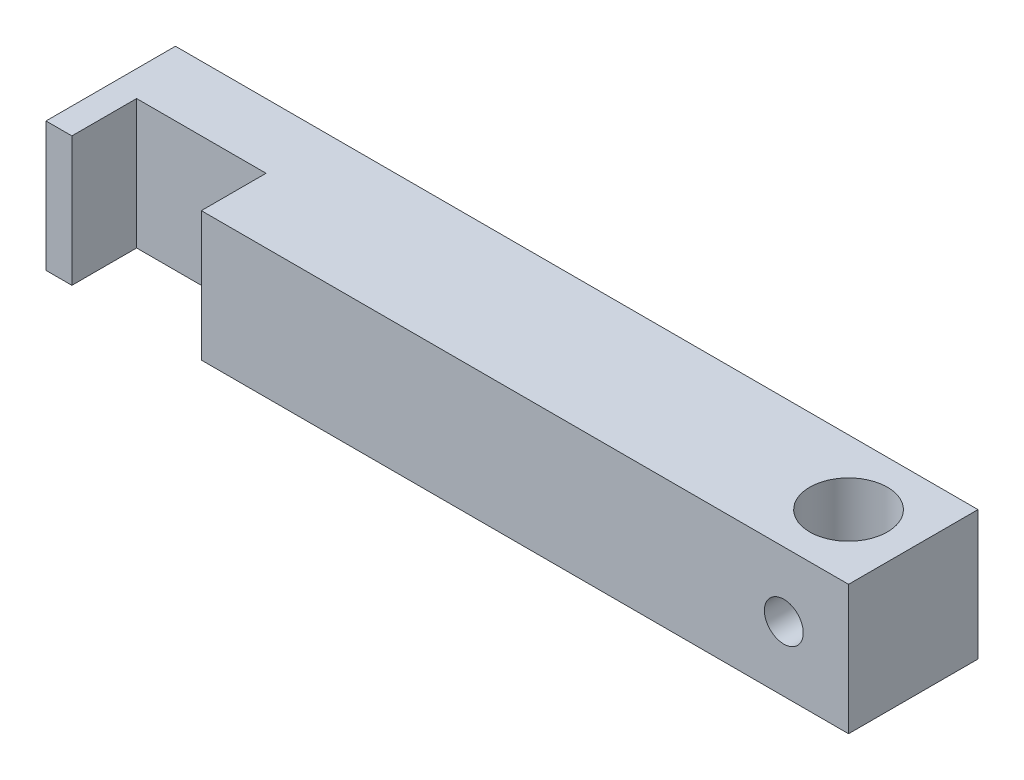
ISO-10303-21;
HEADER;
FILE_DESCRIPTION(('STEP AP214'),'2;1');
FILE_NAME('part.step','',(''),(''),'','','');
FILE_SCHEMA(('AUTOMOTIVE_DESIGN { 1 0 10303 214 1 1 1 1 }'));
ENDSEC;
DATA;
#1=APPLICATION_CONTEXT('core data for automotive mechanical design processes');
#2=APPLICATION_PROTOCOL_DEFINITION('international standard','automotive_design',2000,#1);
#3=PRODUCT_CONTEXT('',#1,'mechanical');
#4=PRODUCT('Part','Part','',(#3));
#5=PRODUCT_RELATED_PRODUCT_CATEGORY('part','',(#4));
#6=PRODUCT_DEFINITION_FORMATION('','',#4);
#7=PRODUCT_DEFINITION_CONTEXT('part definition',#1,'design');
#8=PRODUCT_DEFINITION('design','',#6,#7);
#9=PRODUCT_DEFINITION_SHAPE('','',#8);
#10=(LENGTH_UNIT() NAMED_UNIT(*) SI_UNIT(.MILLI.,.METRE.));
#11=(NAMED_UNIT(*) PLANE_ANGLE_UNIT() SI_UNIT($,.RADIAN.));
#12=(NAMED_UNIT(*) SI_UNIT($,.STERADIAN.) SOLID_ANGLE_UNIT());
#13=UNCERTAINTY_MEASURE_WITH_UNIT(LENGTH_MEASURE(1.E-05),#10,'distance_accuracy_value','');
#14=(GEOMETRIC_REPRESENTATION_CONTEXT(3) GLOBAL_UNCERTAINTY_ASSIGNED_CONTEXT((#13)) GLOBAL_UNIT_ASSIGNED_CONTEXT((#10,
#11,#12)) REPRESENTATION_CONTEXT('',''));
#15=CARTESIAN_POINT('',(0.,0.,0.));
#16=DIRECTION('',(0.,0.,1.));
#17=DIRECTION('',(1.,0.,0.));
#18=AXIS2_PLACEMENT_3D('',#15,#16,#17);
#19=CARTESIAN_POINT('',(0.,5.,0.));
#20=DIRECTION('',(0.,1.,0.));
#21=DIRECTION('',(0.,0.,1.));
#22=AXIS2_PLACEMENT_3D('',#19,#20,#21);
#23=PLANE('',#22);
#24=DIRECTION('',(0.,0.,1.));
#25=VECTOR('',#24,1.);
#26=CARTESIAN_POINT('',(-57.,5.,-5.));
#27=LINE('',#26,#25);
#28=CARTESIAN_POINT('',(-57.,5.,-5.));
#29=VERTEX_POINT('',#28);
#30=CARTESIAN_POINT('',(-57.,5.,5.));
#31=VERTEX_POINT('',#30);
#32=EDGE_CURVE('E155',#29,#31,#27,.T.);
#33=ORIENTED_EDGE('',*,*,#32,.T.);
#34=DIRECTION('',(1.,0.,0.));
#35=VECTOR('',#34,1.);
#36=CARTESIAN_POINT('',(-57.,5.,5.));
#37=LINE('',#36,#35);
#38=CARTESIAN_POINT('',(-55.,5.,5.));
#39=VERTEX_POINT('',#38);
#40=EDGE_CURVE('E103',#31,#39,#37,.T.);
#41=ORIENTED_EDGE('',*,*,#40,.T.);
#42=DIRECTION('',(0.,0.,-1.));
#43=VECTOR('',#42,1.);
#44=CARTESIAN_POINT('',(-55.,5.,5.));
#45=LINE('',#44,#43);
#46=CARTESIAN_POINT('',(-55.,5.,0.));
#47=VERTEX_POINT('',#46);
#48=EDGE_CURVE('E227',#39,#47,#45,.T.);
#49=ORIENTED_EDGE('',*,*,#48,.T.);
#50=DIRECTION('',(1.,0.,0.));
#51=VECTOR('',#50,1.);
#52=CARTESIAN_POINT('',(-55.,5.,0.));
#53=LINE('',#52,#51);
#54=CARTESIAN_POINT('',(-45.,5.,0.));
#55=VERTEX_POINT('',#54);
#56=EDGE_CURVE('E233',#47,#55,#53,.T.);
#57=ORIENTED_EDGE('',*,*,#56,.T.);
#58=DIRECTION('',(0.,0.,1.));
#59=VECTOR('',#58,1.);
#60=CARTESIAN_POINT('',(-45.,5.,0.));
#61=LINE('',#60,#59);
#62=CARTESIAN_POINT('',(-45.,5.,5.));
#63=VERTEX_POINT('',#62);
#64=EDGE_CURVE('E122',#55,#63,#61,.T.);
#65=ORIENTED_EDGE('',*,*,#64,.T.);
#66=DIRECTION('',(1.,0.,0.));
#67=VECTOR('',#66,1.);
#68=CARTESIAN_POINT('',(-45.,5.,5.));
#69=LINE('',#68,#67);
#70=CARTESIAN_POINT('',(5.,5.,5.));
#71=VERTEX_POINT('',#70);
#72=EDGE_CURVE('E116',#63,#71,#69,.T.);
#73=ORIENTED_EDGE('',*,*,#72,.T.);
#74=DIRECTION('',(0.,0.,-1.));
#75=VECTOR('',#74,1.);
#76=CARTESIAN_POINT('',(5.,5.,-5.));
#77=LINE('',#76,#75);
#78=CARTESIAN_POINT('',(5.,5.,-5.));
#79=VERTEX_POINT('',#78);
#80=EDGE_CURVE('E120',#71,#79,#77,.T.);
#81=ORIENTED_EDGE('',*,*,#80,.T.);
#82=DIRECTION('',(-1.,0.,0.));
#83=VECTOR('',#82,1.);
#84=CARTESIAN_POINT('',(-57.,5.,-5.));
#85=LINE('',#84,#83);
#86=EDGE_CURVE('E60',#79,#29,#85,.T.);
#87=ORIENTED_EDGE('',*,*,#86,.T.);
#88=EDGE_LOOP('',(#33,#41,#49,#57,#65,#73,#81,#87));
#89=FACE_BOUND('',#88,.T.);
#90=CARTESIAN_POINT('',(0.,5.,0.));
#91=DIRECTION('',(0.,1.,0.));
#92=DIRECTION('',(0.,0.,1.));
#93=AXIS2_PLACEMENT_3D('',#90,#91,#92);
#94=CIRCLE('',#93,3.);
#95=CARTESIAN_POINT('',(0.,5.,3.));
#96=VERTEX_POINT('',#95);
#97=EDGE_CURVE('E144',#96,#96,#94,.T.);
#98=ORIENTED_EDGE('',*,*,#97,.F.);
#99=EDGE_LOOP('',(#98));
#100=FACE_BOUND('',#99,.T.);
#101=ADVANCED_FACE('F36',(#89,#100),#23,.T.);
#102=CARTESIAN_POINT('',(0.,-5.,0.));
#103=DIRECTION('',(0.,1.,0.));
#104=DIRECTION('',(0.,0.,1.));
#105=AXIS2_PLACEMENT_3D('',#102,#103,#104);
#106=PLANE('',#105);
#107=DIRECTION('',(0.,0.,1.));
#108=VECTOR('',#107,1.);
#109=CARTESIAN_POINT('',(-57.,-5.,-5.));
#110=LINE('',#109,#108);
#111=CARTESIAN_POINT('',(-57.,-5.,-5.));
#112=VERTEX_POINT('',#111);
#113=CARTESIAN_POINT('',(-57.,-5.,5.));
#114=VERTEX_POINT('',#113);
#115=EDGE_CURVE('E140',#112,#114,#110,.T.);
#116=ORIENTED_EDGE('',*,*,#115,.F.);
#117=DIRECTION('',(-1.,0.,0.));
#118=VECTOR('',#117,1.);
#119=CARTESIAN_POINT('',(-57.,-5.,-5.));
#120=LINE('',#119,#118);
#121=CARTESIAN_POINT('',(5.,-5.,-5.));
#122=VERTEX_POINT('',#121);
#123=EDGE_CURVE('E95',#122,#112,#120,.T.);
#124=ORIENTED_EDGE('',*,*,#123,.F.);
#125=DIRECTION('',(0.,0.,-1.));
#126=VECTOR('',#125,1.);
#127=CARTESIAN_POINT('',(5.,-5.,-5.));
#128=LINE('',#127,#126);
#129=CARTESIAN_POINT('',(5.,-5.,5.));
#130=VERTEX_POINT('',#129);
#131=EDGE_CURVE('E89',#130,#122,#128,.T.);
#132=ORIENTED_EDGE('',*,*,#131,.F.);
#133=DIRECTION('',(1.,0.,0.));
#134=VECTOR('',#133,1.);
#135=CARTESIAN_POINT('',(-45.,-5.,5.));
#136=LINE('',#135,#134);
#137=CARTESIAN_POINT('',(-45.,-5.,5.));
#138=VERTEX_POINT('',#137);
#139=EDGE_CURVE('E130',#138,#130,#136,.T.);
#140=ORIENTED_EDGE('',*,*,#139,.F.);
#141=DIRECTION('',(0.,0.,1.));
#142=VECTOR('',#141,1.);
#143=CARTESIAN_POINT('',(-45.,-5.,0.));
#144=LINE('',#143,#142);
#145=CARTESIAN_POINT('',(-45.,-5.,0.));
#146=VERTEX_POINT('',#145);
#147=EDGE_CURVE('E150',#146,#138,#144,.T.);
#148=ORIENTED_EDGE('',*,*,#147,.F.);
#149=DIRECTION('',(1.,0.,0.));
#150=VECTOR('',#149,1.);
#151=CARTESIAN_POINT('',(-55.,-5.,0.));
#152=LINE('',#151,#150);
#153=CARTESIAN_POINT('',(-55.,-5.,0.));
#154=VERTEX_POINT('',#153);
#155=EDGE_CURVE('E148',#154,#146,#152,.T.);
#156=ORIENTED_EDGE('',*,*,#155,.F.);
#157=DIRECTION('',(0.,0.,-1.));
#158=VECTOR('',#157,1.);
#159=CARTESIAN_POINT('',(-55.,-5.,5.));
#160=LINE('',#159,#158);
#161=CARTESIAN_POINT('',(-55.,-5.,5.));
#162=VERTEX_POINT('',#161);
#163=EDGE_CURVE('E146',#162,#154,#160,.T.);
#164=ORIENTED_EDGE('',*,*,#163,.F.);
#165=DIRECTION('',(1.,0.,0.));
#166=VECTOR('',#165,1.);
#167=CARTESIAN_POINT('',(-57.,-5.,5.));
#168=LINE('',#167,#166);
#169=EDGE_CURVE('E143',#114,#162,#168,.T.);
#170=ORIENTED_EDGE('',*,*,#169,.F.);
#171=EDGE_LOOP('',(#116,#124,#132,#140,#148,#156,#164,#170));
#172=FACE_BOUND('',#171,.T.);
#173=CARTESIAN_POINT('',(0.,-5.,0.));
#174=DIRECTION('',(0.,1.,0.));
#175=DIRECTION('',(0.,0.,1.));
#176=AXIS2_PLACEMENT_3D('',#173,#174,#175);
#177=CIRCLE('',#176,3.);
#178=CARTESIAN_POINT('',(0.,-5.,3.));
#179=VERTEX_POINT('',#178);
#180=EDGE_CURVE('E239',#179,#179,#177,.T.);
#181=ORIENTED_EDGE('',*,*,#180,.T.);
#182=EDGE_LOOP('',(#181));
#183=FACE_BOUND('',#182,.T.);
#184=ADVANCED_FACE('F190',(#172,#183),#106,.F.);
#185=CARTESIAN_POINT('',(-57.,5.,-5.));
#186=DIRECTION('',(1.,0.,0.));
#187=DIRECTION('',(0.,0.,-1.));
#188=AXIS2_PLACEMENT_3D('',#185,#186,#187);
#189=PLANE('',#188);
#190=ORIENTED_EDGE('',*,*,#115,.T.);
#191=DIRECTION('',(0.,-1.,0.));
#192=VECTOR('',#191,1.);
#193=CARTESIAN_POINT('',(-57.,5.,5.));
#194=LINE('',#193,#192);
#195=EDGE_CURVE('E11',#31,#114,#194,.T.);
#196=ORIENTED_EDGE('',*,*,#195,.F.);
#197=ORIENTED_EDGE('',*,*,#32,.F.);
#198=DIRECTION('',(0.,-1.,0.));
#199=VECTOR('',#198,1.);
#200=CARTESIAN_POINT('',(-57.,5.,-5.));
#201=LINE('',#200,#199);
#202=EDGE_CURVE('E136',#29,#112,#201,.T.);
#203=ORIENTED_EDGE('',*,*,#202,.T.);
#204=EDGE_LOOP('',(#190,#196,#197,#203));
#205=FACE_BOUND('',#204,.T.);
#206=ADVANCED_FACE('F38',(#205),#189,.F.);
#207=CARTESIAN_POINT('',(-57.,5.,5.));
#208=DIRECTION('',(0.,0.,-1.));
#209=DIRECTION('',(-1.,0.,0.));
#210=AXIS2_PLACEMENT_3D('',#207,#208,#209);
#211=PLANE('',#210);
#212=ORIENTED_EDGE('',*,*,#169,.T.);
#213=DIRECTION('',(0.,-1.,0.));
#214=VECTOR('',#213,1.);
#215=CARTESIAN_POINT('',(-55.,5.,5.));
#216=LINE('',#215,#214);
#217=EDGE_CURVE('E51',#39,#162,#216,.T.);
#218=ORIENTED_EDGE('',*,*,#217,.F.);
#219=ORIENTED_EDGE('',*,*,#40,.F.);
#220=ORIENTED_EDGE('',*,*,#195,.T.);
#221=EDGE_LOOP('',(#212,#218,#219,#220));
#222=FACE_BOUND('',#221,.T.);
#223=ADVANCED_FACE('F215',(#222),#211,.F.);
#224=CARTESIAN_POINT('',(-55.,5.,5.));
#225=DIRECTION('',(-1.,0.,0.));
#226=DIRECTION('',(0.,0.,1.));
#227=AXIS2_PLACEMENT_3D('',#224,#225,#226);
#228=PLANE('',#227);
#229=ORIENTED_EDGE('',*,*,#163,.T.);
#230=DIRECTION('',(0.,-1.,0.));
#231=VECTOR('',#230,1.);
#232=CARTESIAN_POINT('',(-55.,5.,0.));
#233=LINE('',#232,#231);
#234=EDGE_CURVE('E162',#47,#154,#233,.T.);
#235=ORIENTED_EDGE('',*,*,#234,.F.);
#236=ORIENTED_EDGE('',*,*,#48,.F.);
#237=ORIENTED_EDGE('',*,*,#217,.T.);
#238=EDGE_LOOP('',(#229,#235,#236,#237));
#239=FACE_BOUND('',#238,.T.);
#240=ADVANCED_FACE('F212',(#239),#228,.F.);
#241=CARTESIAN_POINT('',(-55.,5.,0.));
#242=DIRECTION('',(0.,0.,-1.));
#243=DIRECTION('',(-1.,0.,0.));
#244=AXIS2_PLACEMENT_3D('',#241,#242,#243);
#245=PLANE('',#244);
#246=ORIENTED_EDGE('',*,*,#155,.T.);
#247=DIRECTION('',(0.,-1.,0.));
#248=VECTOR('',#247,1.);
#249=CARTESIAN_POINT('',(-45.,5.,0.));
#250=LINE('',#249,#248);
#251=EDGE_CURVE('E159',#55,#146,#250,.T.);
#252=ORIENTED_EDGE('',*,*,#251,.F.);
#253=ORIENTED_EDGE('',*,*,#56,.F.);
#254=ORIENTED_EDGE('',*,*,#234,.T.);
#255=EDGE_LOOP('',(#246,#252,#253,#254));
#256=FACE_BOUND('',#255,.T.);
#257=ADVANCED_FACE('F208',(#256),#245,.F.);
#258=CARTESIAN_POINT('',(-45.,5.,0.));
#259=DIRECTION('',(1.,0.,0.));
#260=DIRECTION('',(0.,0.,-1.));
#261=AXIS2_PLACEMENT_3D('',#258,#259,#260);
#262=PLANE('',#261);
#263=ORIENTED_EDGE('',*,*,#147,.T.);
#264=DIRECTION('',(0.,-1.,0.));
#265=VECTOR('',#264,1.);
#266=CARTESIAN_POINT('',(-45.,5.,5.));
#267=LINE('',#266,#265);
#268=EDGE_CURVE('E131',#63,#138,#267,.T.);
#269=ORIENTED_EDGE('',*,*,#268,.F.);
#270=ORIENTED_EDGE('',*,*,#64,.F.);
#271=ORIENTED_EDGE('',*,*,#251,.T.);
#272=EDGE_LOOP('',(#263,#269,#270,#271));
#273=FACE_BOUND('',#272,.T.);
#274=ADVANCED_FACE('F204',(#273),#262,.F.);
#275=CARTESIAN_POINT('',(-45.,5.,5.));
#276=DIRECTION('',(0.,0.,-1.));
#277=DIRECTION('',(-1.,0.,0.));
#278=AXIS2_PLACEMENT_3D('',#275,#276,#277);
#279=PLANE('',#278);
#280=CARTESIAN_POINT('',(0.,0.,5.));
#281=DIRECTION('',(0.,0.,1.));
#282=DIRECTION('',(1.,0.,0.));
#283=AXIS2_PLACEMENT_3D('',#280,#281,#282);
#284=CIRCLE('',#283,1.5);
#285=CARTESIAN_POINT('',(1.5,0.,5.));
#286=VERTEX_POINT('',#285);
#287=EDGE_CURVE('E244',#286,#286,#284,.T.);
#288=ORIENTED_EDGE('',*,*,#287,.F.);
#289=EDGE_LOOP('',(#288));
#290=FACE_BOUND('',#289,.T.);
#291=ORIENTED_EDGE('',*,*,#139,.T.);
#292=DIRECTION('',(0.,-1.,0.));
#293=VECTOR('',#292,1.);
#294=CARTESIAN_POINT('',(5.,5.,5.));
#295=LINE('',#294,#293);
#296=EDGE_CURVE('E127',#71,#130,#295,.T.);
#297=ORIENTED_EDGE('',*,*,#296,.F.);
#298=ORIENTED_EDGE('',*,*,#72,.F.);
#299=ORIENTED_EDGE('',*,*,#268,.T.);
#300=EDGE_LOOP('',(#291,#297,#298,#299));
#301=FACE_BOUND('',#300,.T.);
#302=ADVANCED_FACE('F128',(#290,#301),#279,.F.);
#303=CARTESIAN_POINT('',(5.,5.,-5.));
#304=DIRECTION('',(-1.,0.,0.));
#305=DIRECTION('',(0.,0.,1.));
#306=AXIS2_PLACEMENT_3D('',#303,#304,#305);
#307=PLANE('',#306);
#308=ORIENTED_EDGE('',*,*,#131,.T.);
#309=DIRECTION('',(0.,-1.,0.));
#310=VECTOR('',#309,1.);
#311=CARTESIAN_POINT('',(5.,5.,-5.));
#312=LINE('',#311,#310);
#313=EDGE_CURVE('E132',#79,#122,#312,.T.);
#314=ORIENTED_EDGE('',*,*,#313,.F.);
#315=ORIENTED_EDGE('',*,*,#80,.F.);
#316=ORIENTED_EDGE('',*,*,#296,.T.);
#317=EDGE_LOOP('',(#308,#314,#315,#316));
#318=FACE_BOUND('',#317,.T.);
#319=ADVANCED_FACE('F134',(#318),#307,.F.);
#320=CARTESIAN_POINT('',(-57.,5.,-5.));
#321=DIRECTION('',(0.,0.,1.));
#322=DIRECTION('',(1.,0.,0.));
#323=AXIS2_PLACEMENT_3D('',#320,#321,#322);
#324=PLANE('',#323);
#325=CARTESIAN_POINT('',(0.,0.,-5.));
#326=DIRECTION('',(0.,0.,1.));
#327=DIRECTION('',(1.,0.,0.));
#328=AXIS2_PLACEMENT_3D('',#325,#326,#327);
#329=CIRCLE('',#328,1.5);
#330=CARTESIAN_POINT('',(1.5,0.,-5.));
#331=VERTEX_POINT('',#330);
#332=EDGE_CURVE('E171',#331,#331,#329,.T.);
#333=ORIENTED_EDGE('',*,*,#332,.T.);
#334=EDGE_LOOP('',(#333));
#335=FACE_BOUND('',#334,.T.);
#336=ORIENTED_EDGE('',*,*,#123,.T.);
#337=ORIENTED_EDGE('',*,*,#202,.F.);
#338=ORIENTED_EDGE('',*,*,#86,.F.);
#339=ORIENTED_EDGE('',*,*,#313,.T.);
#340=EDGE_LOOP('',(#336,#337,#338,#339));
#341=FACE_BOUND('',#340,.T.);
#342=ADVANCED_FACE('F186',(#335,#341),#324,.F.);
#343=CARTESIAN_POINT('',(0.,5.,0.));
#344=DIRECTION('',(0.,-1.,0.));
#345=DIRECTION('',(0.,0.,-1.));
#346=AXIS2_PLACEMENT_3D('',#343,#344,#345);
#347=CYLINDRICAL_SURFACE('',#346,3.);
#348=CARTESIAN_POINT('',(0.,1.5,-3.));
#349=CARTESIAN_POINT('',(-0.0788579444268502,1.49999504652421,-2.99999570107562));
#350=CARTESIAN_POINT('',(-0.157809899546344,1.49374489031842,-2.99685736529635));
#351=CARTESIAN_POINT('',(-0.313380352903344,1.46902067948769,-2.98461234055736));
#352=CARTESIAN_POINT('',(-0.389994130070444,1.45052341050328,-2.97549431743379));
#353=CARTESIAN_POINT('',(-0.538400317320674,1.40220928707506,-2.95224419105063));
#354=CARTESIAN_POINT('',(-0.61021020440872,1.37243642362805,-2.93813158766306));
#355=CARTESIAN_POINT('',(-0.747708925209899,1.30264406795252,-2.90618664773642));
#356=CARTESIAN_POINT('',(-0.813398240985089,1.2626253836267,-2.88835460450288));
#357=CARTESIAN_POINT('',(-0.941261726642864,1.17072412577207,-2.84934387387093));
#358=CARTESIAN_POINT('',(-1.00298281668316,1.11827028114054,-2.82802798691306));
#359=CARTESIAN_POINT('',(-1.11716916730047,1.00421778112945,-2.78489955370115));
#360=CARTESIAN_POINT('',(-1.16962737466015,0.942612222341338,-2.76308664313552));
#361=CARTESIAN_POINT('',(-1.26787800067542,0.806274975714928,-2.71948426796021));
#362=CARTESIAN_POINT('',(-1.31283800332746,0.730895852481131,-2.69782780455198));
#363=CARTESIAN_POINT('',(-1.38925234033604,0.572448996020678,-2.65928968158481));
#364=CARTESIAN_POINT('',(-1.4207163224495,0.489386806915876,-2.64240461410484));
#365=CARTESIAN_POINT('',(-1.46719866328288,0.323002341867116,-2.61686800556713));
#366=CARTESIAN_POINT('',(-1.48308878562066,0.239993321898908,-2.6077840737557));
#367=CARTESIAN_POINT('',(-1.50064048996327,0.0720317433307841,-2.59772834922792));
#368=CARTESIAN_POINT('',(-1.50231613255961,-0.0129188113067328,-2.59674854014932));
#369=CARTESIAN_POINT('',(-1.49203093075844,-0.171429036473053,-2.60266395385873));
#370=CARTESIAN_POINT('',(-1.48167683930523,-0.245136046834576,-2.6086314549302));
#371=CARTESIAN_POINT('',(-1.4504097735854,-0.389582864059564,-2.62614343100775));
#372=CARTESIAN_POINT('',(-1.42949343584648,-0.460321717957974,-2.63768968247664));
#373=CARTESIAN_POINT('',(-1.37731467057901,-0.598843698848489,-2.66531214619112));
#374=CARTESIAN_POINT('',(-1.34582260067399,-0.666519598178684,-2.68148760995998));
#375=CARTESIAN_POINT('',(-1.273562531502,-0.795951438885012,-2.71655106422106));
#376=CARTESIAN_POINT('',(-1.2327903657187,-0.857704703400134,-2.73544027170286));
#377=CARTESIAN_POINT('',(-1.13709908236918,-0.981781879114839,-2.77669736854929));
#378=CARTESIAN_POINT('',(-1.08104168755392,-1.04318531036424,-2.79920265355119));
#379=CARTESIAN_POINT('',(-0.95933336811206,-1.15610312788635,-2.84321434950611));
#380=CARTESIAN_POINT('',(-0.893677884861428,-1.20761278805082,-2.86472027938201));
#381=CARTESIAN_POINT('',(-0.750774758747772,-1.30152849154459,-2.90552980924446));
#382=CARTESIAN_POINT('',(-0.673130387399113,-1.34340070866861,-2.92468476243011));
#383=CARTESIAN_POINT('',(-0.510699323233195,-1.41314554356451,-2.95736821681863));
#384=CARTESIAN_POINT('',(-0.425918364397914,-1.44102927752275,-2.9709011841533));
#385=CARTESIAN_POINT('',(-0.259149737491053,-1.47971310557502,-2.98986500612153));
#386=CARTESIAN_POINT('',(-0.177512295822489,-1.49173685362017,-2.99587407451965));
#387=CARTESIAN_POINT('',(-0.0131693999240273,-1.50219709670173,-3.00109520188655));
#388=CARTESIAN_POINT('',(0.0695355298048632,-1.5006400284592,-3.00031048081978));
#389=CARTESIAN_POINT('',(0.22684945797898,-1.48468996737188,-2.99236788380152));
#390=CARTESIAN_POINT('',(0.301589112074895,-1.47130120090501,-2.98570868532252));
#391=CARTESIAN_POINT('',(0.447610338452912,-1.43364289215732,-2.9673325697226));
#392=CARTESIAN_POINT('',(0.518891528536631,-1.40937215031976,-2.95561509501618));
#393=CARTESIAN_POINT('',(0.658332912674359,-1.35000230035045,-2.92776377120382));
#394=CARTESIAN_POINT('',(0.726345595508705,-1.31461342482557,-2.91151322654446));
#395=CARTESIAN_POINT('',(0.855692042548907,-1.23433869653015,-2.87615961476126));
#396=CARTESIAN_POINT('',(0.917022944664887,-1.18944879810691,-2.85705533350407));
#397=CARTESIAN_POINT('',(1.03765153393382,-1.08635936200393,-2.81562332004297));
#398=CARTESIAN_POINT('',(1.09615811672854,-1.02728569733228,-2.79316327265249));
#399=CARTESIAN_POINT('',(1.20278448167828,-0.900112273083409,-2.7489358741323));
#400=CARTESIAN_POINT('',(1.25089707856781,-0.83200632172812,-2.72716901100071));
#401=CARTESIAN_POINT('',(1.33756187171853,-0.684534518740536,-2.68576788309734));
#402=CARTESIAN_POINT('',(1.37553824370037,-0.604783100858277,-2.66628794383591));
#403=CARTESIAN_POINT('',(1.43712423890206,-0.43873489863755,-2.63361108441202));
#404=CARTESIAN_POINT('',(1.46075237380052,-0.352446710299664,-2.62040607332625));
#405=CARTESIAN_POINT('',(1.49079253120031,-0.184634665672943,-2.60342251538703));
#406=CARTESIAN_POINT('',(1.49863949460818,-0.103448619847136,-2.59886075197597));
#407=CARTESIAN_POINT('',(1.5010337315643,0.0591706007467883,-2.59748031962405));
#408=CARTESIAN_POINT('',(1.49558676993486,0.140603653106793,-2.60065829439585));
#409=CARTESIAN_POINT('',(1.47288918838996,0.293225252300156,-2.61356793076615));
#410=CARTESIAN_POINT('',(1.45681247151455,0.36465070521711,-2.62264641723988));
#411=CARTESIAN_POINT('',(1.41476303733662,0.503712179136551,-2.64556524281479));
#412=CARTESIAN_POINT('',(1.38878713673988,0.571346973138048,-2.65940711354503));
#413=CARTESIAN_POINT('',(1.32572361795085,0.705937276479806,-2.69142795546804));
#414=CARTESIAN_POINT('',(1.28800670672355,0.772541852743542,-2.70983583593881));
#415=CARTESIAN_POINT('',(1.20322645745609,0.898911804271888,-2.74852997452291));
#416=CARTESIAN_POINT('',(1.15615825686234,0.958673595781668,-2.76881720693416));
#417=CARTESIAN_POINT('',(1.04730498999206,1.07721297353201,-2.81193484737138));
#418=CARTESIAN_POINT('',(0.984426634495891,1.13498865352544,-2.83477474959942));
#419=CARTESIAN_POINT('',(0.849232209349795,1.2393944751529,-2.87816628389896));
#420=CARTESIAN_POINT('',(0.776911084957795,1.28601860920486,-2.89871667939293));
#421=CARTESIAN_POINT('',(0.623897395174418,1.36685454406811,-2.93547014349806));
#422=CARTESIAN_POINT('',(0.543149255665095,1.4009762538547,-2.95164144740899));
#423=CARTESIAN_POINT('',(0.376113151707129,1.45471225163611,-2.9775201194848));
#424=CARTESIAN_POINT('',(0.289841699383649,1.47436777020857,-2.98724585044602));
#425=CARTESIAN_POINT('',(0.168902919736342,1.49084611662861,-2.99543192870217));
#426=CARTESIAN_POINT('',(0.135242819162347,1.49427396129951,-2.99714048010376));
#427=CARTESIAN_POINT('',(0.067727597707637,1.49885199827113,-2.99942545465223));
#428=CARTESIAN_POINT('',(0.0338724714699425,1.50000212770531,-3.00000184655071));
#429=CARTESIAN_POINT('',(0.,1.5,-3.));
#430=B_SPLINE_CURVE_WITH_KNOTS('',3,(#348,#349,#350,#351,#352,#353,#354,#355,#356,#357,#358,
#359,#360,#361,#362,#363,#364,#365,#366,#367,#368,#369,#370,#371,#372,#373,#374,#375,#376,#377,
#378,#379,#380,#381,#382,#383,#384,#385,#386,#387,#388,#389,#390,#391,#392,#393,#394,#395,#396,
#397,#398,#399,#400,#401,#402,#403,#404,#405,#406,#407,#408,#409,#410,#411,#412,#413,#414,#415,
#416,#417,#418,#419,#420,#421,#422,#423,#424,#425,#426,#427,#428,#429),.UNSPECIFIED.,.T.,.F.,(4,
2,2,2,2,2,2,2,2,2,2,2,2,2,2,2,2,2,2,2,2,2,2,2,2,2,2,2,2,2,2,2,2,2,2,2,2,2,2,2,4),(0.,
0.236436386130439,0.473322224563797,0.709293233238448,0.945245640872352,1.19547263807713,
1.44588935648105,1.71572589646129,1.98536921847421,2.23887018210344,2.49212035993531,
2.71508568613981,2.93812205888518,3.16635360252731,3.39468781890333,3.65197412000818,
3.90938301898029,4.17874533321661,4.44789325368419,4.69474935707018,4.94148846767214,
5.16910359759183,5.39674382446397,5.63089284041848,5.86514176122509,6.12239415966628,
6.37982382923148,6.64972023242589,6.91926767918176,7.1629396125457,7.40650589797018,
7.62686895373284,7.84730293182527,8.08254685170431,8.31791341715446,8.58187864135757,
8.84598575071869,9.1119602049529,9.37717362931724,9.47872920200875,9.58028757766599),.UNSPECIFIED.);
#431=CARTESIAN_POINT('',(0.,1.5,-3.));
#432=VERTEX_POINT('',#431);
#433=EDGE_CURVE('E40',#432,#432,#430,.T.);
#434=ORIENTED_EDGE('',*,*,#433,.F.);
#435=EDGE_LOOP('',(#434));
#436=FACE_BOUND('',#435,.T.);
#437=CARTESIAN_POINT('',(1.5,0.,2.59807621135332));
#438=CARTESIAN_POINT('',(1.4999945446118,-0.0781617122928752,2.59808302092689));
#439=CARTESIAN_POINT('',(1.49384995609983,-0.156422117287568,2.60165701781635));
#440=CARTESIAN_POINT('',(1.46958481484708,-0.310540897015729,2.61543549678079));
#441=CARTESIAN_POINT('',(1.45143909683127,-0.386393872565113,2.62565391083339));
#442=CARTESIAN_POINT('',(1.40414992304972,-0.533177496515911,2.65124019908098));
#443=CARTESIAN_POINT('',(1.3750649287406,-0.60413197871038,2.66658065209878));
#444=CARTESIAN_POINT('',(1.30690128806456,-0.740136302995079,2.70063997225287));
#445=CARTESIAN_POINT('',(1.26782210105366,-0.805185825393686,2.71935902214097));
#446=CARTESIAN_POINT('',(1.17699981079632,-0.933458592836259,2.75995303586162));
#447=CARTESIAN_POINT('',(1.12447805421566,-0.996088703510315,2.7819609545693));
#448=CARTESIAN_POINT('',(1.0098807114217,-1.11211258261006,2.82557974178559));
#449=CARTESIAN_POINT('',(0.94780038867344,-1.16550174387528,2.84719040746875));
#450=CARTESIAN_POINT('',(0.810734345121819,-1.26505072672149,2.88932215429424));
#451=CARTESIAN_POINT('',(0.735160783518862,-1.3104806517893,2.90967159627259));
#452=CARTESIAN_POINT('',(0.576235539899256,-1.38771127986864,2.94526134149294));
#453=CARTESIAN_POINT('',(0.492888807207233,-1.41952058420576,2.96050486775612));
#454=CARTESIAN_POINT('',(0.327067415888966,-1.46625699195165,2.98320691866356));
#455=CARTESIAN_POINT('',(0.244952685733226,-1.4822242895333,2.99114220331338));
#456=CARTESIAN_POINT('',(0.078855943046772,-1.50024917801256,3.00011375769101));
#457=CARTESIAN_POINT('',(-0.00512490876560788,-1.50231518519357,3.00115420176885));
#458=CARTESIAN_POINT('',(-0.164748786635625,-1.49287998904448,2.99644472874675));
#459=CARTESIAN_POINT('',(-0.240481798765187,-1.48254297671817,2.99127743838241));
#460=CARTESIAN_POINT('',(-0.388970657877483,-1.45067873414301,2.97561367889621));
#461=CARTESIAN_POINT('',(-0.461726281640888,-1.42915066653567,2.96511681099591));
#462=CARTESIAN_POINT('',(-0.60346408735433,-1.37537615086528,2.93957374931482));
#463=CARTESIAN_POINT('',(-0.672380135272768,-1.3429855302419,2.92446662293799));
#464=CARTESIAN_POINT('',(-0.803965202269993,-1.26860487569776,2.89106468980031));
#465=CARTESIAN_POINT('',(-0.866631973257969,-1.22661140504648,2.87276874236226));
#466=CARTESIAN_POINT('',(-0.990260491347293,-1.12965697270048,2.83266591598844));
#467=CARTESIAN_POINT('',(-1.05050111254404,-1.07384545751099,2.81069063997263));
#468=CARTESIAN_POINT('',(-1.16115655544667,-0.953115412604735,2.76681510880218));
#469=CARTESIAN_POINT('',(-1.21156381736135,-0.888189941588906,2.74491492398443));
#470=CARTESIAN_POINT('',(-1.30425800196332,-0.746027711363869,2.70216234138727));
#471=CARTESIAN_POINT('',(-1.34582597246708,-0.668270965418683,2.68146479986061));
#472=CARTESIAN_POINT('',(-1.41497866950185,-0.505593492961502,2.64563175417864));
#473=CARTESIAN_POINT('',(-1.44257798731633,-0.420680350473657,2.63049045069101));
#474=CARTESIAN_POINT('',(-1.48077031653756,-0.253178233075814,2.60916953725552));
#475=CARTESIAN_POINT('',(-1.49253768317996,-0.170938321434672,2.60237483772745));
#476=CARTESIAN_POINT('',(-1.50227541991714,-0.0053979877251866,2.59676879042414));
#477=CARTESIAN_POINT('',(-1.50025553597254,0.0779016436796812,2.59795180333967));
#478=CARTESIAN_POINT('',(-1.48355406501595,0.233480877868093,2.60751504810877));
#479=CARTESIAN_POINT('',(-1.4702817250687,0.305969176661891,2.61509381259981));
#480=CARTESIAN_POINT('',(-1.43354442694866,0.447551679406438,2.63541032327012));
#481=CARTESIAN_POINT('',(-1.41007616793542,0.516644776119913,2.64814974007551));
#482=CARTESIAN_POINT('',(-1.35247138290733,0.653116996354044,2.67804333119485));
#483=CARTESIAN_POINT('',(-1.31789109553909,0.720268525280329,2.69537464864595));
#484=CARTESIAN_POINT('',(-1.23943059602371,0.84820390730849,2.73234179245875));
#485=CARTESIAN_POINT('',(-1.19554560649832,0.908984465269925,2.75197880032721));
#486=CARTESIAN_POINT('',(-1.09325575079828,1.03046815128532,2.79431997684504));
#487=CARTESIAN_POINT('',(-1.03371790847245,1.09019572607649,2.81709874731434));
#488=CARTESIAN_POINT('',(-0.905106743097433,1.19911835699039,2.86101352466839));
#489=CARTESIAN_POINT('',(-0.836030211983021,1.24830985534581,2.88214897511564));
#490=CARTESIAN_POINT('',(-0.687803043838136,1.33586058892515,2.92112042536435));
#491=CARTESIAN_POINT('',(-0.60843464636117,1.37389967731637,2.93885462508044));
#492=CARTESIAN_POINT('',(-0.443283546961623,1.43570685578609,2.96825032438952));
#493=CARTESIAN_POINT('',(-0.357506552088264,1.45948747704946,2.9799171551456));
#494=CARTESIAN_POINT('',(-0.190469523495626,1.49005284626199,2.99501262272824));
#495=CARTESIAN_POINT('',(-0.109517165775686,1.49819681381417,2.99909891862287));
#496=CARTESIAN_POINT('',(0.0526889789268053,1.5012648981816,3.00063195562697));
#497=CARTESIAN_POINT('',(0.13394265044263,1.49619364278535,2.99808102100335));
#498=CARTESIAN_POINT('',(0.288806988475721,1.47387538980656,2.98700953256884));
#499=CARTESIAN_POINT('',(0.362568476716896,1.45745272611349,2.97889342001985));
#500=CARTESIAN_POINT('',(0.506168928275426,1.41400950104554,2.95788140495135));
#501=CARTESIAN_POINT('',(0.576007327433263,1.38698741985982,2.94498481699194));
#502=CARTESIAN_POINT('',(0.713135109367327,1.32190942175104,2.9148889612218));
#503=CARTESIAN_POINT('',(0.780187714050069,1.28343101518824,2.89752925798199));
#504=CARTESIAN_POINT('',(0.907161962721037,1.19706310371142,2.86032199712739));
#505=CARTESIAN_POINT('',(0.967080311122361,1.14916927632649,2.84047329837541));
#506=CARTESIAN_POINT('',(1.08437100623534,1.03980429146595,2.79792915339941));
#507=CARTESIAN_POINT('',(1.14089652680891,0.977456268784211,2.77514698517547));
#508=CARTESIAN_POINT('',(1.24299493109201,0.843823918305344,2.73094614244278));
#509=CARTESIAN_POINT('',(1.28855812501509,0.772531768698474,2.70952868642798));
#510=CARTESIAN_POINT('',(1.36864661967848,0.620045030128568,2.66999407957374));
#511=CARTESIAN_POINT('',(1.40277759894141,0.538608703306896,2.65200261384405));
#512=CARTESIAN_POINT('',(1.45631806425962,0.370001393490333,2.62299234492527));
#513=CARTESIAN_POINT('',(1.47577678676302,0.28285066663097,2.61195024221553));
#514=CARTESIAN_POINT('',(1.49155051179662,0.162291966522006,2.60293908902686));
#515=CARTESIAN_POINT('',(1.49471415744578,0.129948158403175,2.60112193507728));
#516=CARTESIAN_POINT('',(1.49894010763494,0.0650752789766351,2.59868903831625));
#517=CARTESIAN_POINT('',(1.50000227159981,0.0325461954211887,2.59807337587664));
#518=CARTESIAN_POINT('',(1.5,0.,2.59807621135332));
#519=B_SPLINE_CURVE_WITH_KNOTS('',3,(#437,#438,#439,#440,#441,#442,#443,#444,#445,#446,#447,
#448,#449,#450,#451,#452,#453,#454,#455,#456,#457,#458,#459,#460,#461,#462,#463,#464,#465,#466,
#467,#468,#469,#470,#471,#472,#473,#474,#475,#476,#477,#478,#479,#480,#481,#482,#483,#484,#485,
#486,#487,#488,#489,#490,#491,#492,#493,#494,#495,#496,#497,#498,#499,#500,#501,#502,#503,#504,
#505,#506,#507,#508,#509,#510,#511,#512,#513,#514,#515,#516,#517,#518),.UNSPECIFIED.,.T.,.F.,(4,
2,2,2,2,2,2,2,2,2,2,2,2,2,2,2,2,2,2,2,2,2,2,2,2,2,2,2,2,2,2,2,2,2,2,2,2,2,2,2,4),(0.,
0.234348183892073,0.469189339237207,0.702792893878328,0.936409088167725,1.18929346874735,
1.44230356626556,1.71236838358145,1.98226240445837,2.23295227451903,2.4834903552906,
2.71224146226808,2.94100968776183,3.1729430209672,3.40495949025408,3.65890787185336,
3.91305072368878,4.18333262594173,4.45333161317557,4.70193436281318,4.9503613978256,
5.17161275136038,5.39293578654095,5.62450944609132,5.85620229330071,6.1171011537092,
6.37808797467303,6.64596272119449,6.91360169713157,7.1566840558423,7.39968130190958,
7.62666637307239,7.8536840026802,8.09041126079208,8.32724745151079,8.58765362775101,
8.84828914267731,9.11716123557908,9.38512699504141,9.48270202777964,9.58028358741811),.UNSPECIFIED.);
#520=CARTESIAN_POINT('',(1.5,0.,2.59807621135332));
#521=VERTEX_POINT('',#520);
#522=EDGE_CURVE('E166',#521,#521,#519,.T.);
#523=ORIENTED_EDGE('',*,*,#522,.F.);
#524=EDGE_LOOP('',(#523));
#525=FACE_BOUND('',#524,.T.);
#526=ORIENTED_EDGE('',*,*,#97,.T.);
#527=EDGE_LOOP('',(#526));
#528=FACE_BOUND('',#527,.T.);
#529=ORIENTED_EDGE('',*,*,#180,.F.);
#530=EDGE_LOOP('',(#529));
#531=FACE_BOUND('',#530,.T.);
#532=ADVANCED_FACE('F172',(#436,#525,#528,#531),#347,.F.);
#533=CARTESIAN_POINT('',(0.,0.,-5.));
#534=DIRECTION('',(0.,0.,1.));
#535=DIRECTION('',(1.,0.,0.));
#536=AXIS2_PLACEMENT_3D('',#533,#534,#535);
#537=CYLINDRICAL_SURFACE('',#536,1.5);
#538=ORIENTED_EDGE('',*,*,#522,.T.);
#539=EDGE_LOOP('',(#538));
#540=FACE_BOUND('',#539,.T.);
#541=ORIENTED_EDGE('',*,*,#287,.T.);
#542=EDGE_LOOP('',(#541));
#543=FACE_BOUND('',#542,.T.);
#544=ADVANCED_FACE('F175',(#540,#543),#537,.F.);
#545=ORIENTED_EDGE('',*,*,#433,.T.);
#546=EDGE_LOOP('',(#545));
#547=FACE_BOUND('',#546,.T.);
#548=ORIENTED_EDGE('',*,*,#332,.F.);
#549=EDGE_LOOP('',(#548));
#550=FACE_BOUND('',#549,.T.);
#551=ADVANCED_FACE('F178',(#547,#550),#537,.F.);
#552=CLOSED_SHELL('',(#101,#184,#206,#223,#240,#257,#274,#302,#319,#342,#532,#544,#551));
#553=MANIFOLD_SOLID_BREP('B2',#552);
#554=ADVANCED_BREP_SHAPE_REPRESENTATION('',(#18,#553),#14);
#555=SHAPE_DEFINITION_REPRESENTATION(#9,#554);
ENDSEC;
END-ISO-10303-21;
